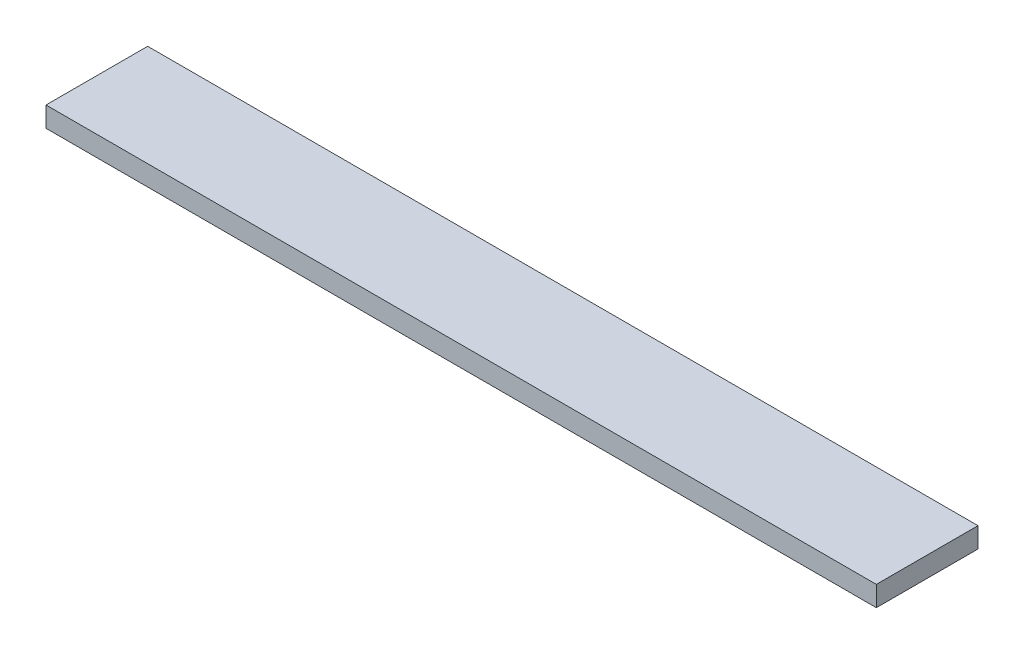
ISO-10303-21;
HEADER;
FILE_DESCRIPTION(('STEP AP214'),'2;1');
FILE_NAME('part.step','',(''),(''),'','','');
FILE_SCHEMA(('AUTOMOTIVE_DESIGN { 1 0 10303 214 1 1 1 1 }'));
ENDSEC;
DATA;
#1=APPLICATION_CONTEXT('core data for automotive mechanical design processes');
#2=APPLICATION_PROTOCOL_DEFINITION('international standard','automotive_design',2000,#1);
#3=PRODUCT_CONTEXT('',#1,'mechanical');
#4=PRODUCT('Part','Part','',(#3));
#5=PRODUCT_RELATED_PRODUCT_CATEGORY('part','',(#4));
#6=PRODUCT_DEFINITION_FORMATION('','',#4);
#7=PRODUCT_DEFINITION_CONTEXT('part definition',#1,'design');
#8=PRODUCT_DEFINITION('design','',#6,#7);
#9=PRODUCT_DEFINITION_SHAPE('','',#8);
#10=(LENGTH_UNIT() NAMED_UNIT(*) SI_UNIT(.MILLI.,.METRE.));
#11=(NAMED_UNIT(*) PLANE_ANGLE_UNIT() SI_UNIT($,.RADIAN.));
#12=(NAMED_UNIT(*) SI_UNIT($,.STERADIAN.) SOLID_ANGLE_UNIT());
#13=UNCERTAINTY_MEASURE_WITH_UNIT(LENGTH_MEASURE(1.E-05),#10,'distance_accuracy_value','');
#14=(GEOMETRIC_REPRESENTATION_CONTEXT(3) GLOBAL_UNCERTAINTY_ASSIGNED_CONTEXT((#13)) GLOBAL_UNIT_ASSIGNED_CONTEXT((#10,
#11,#12)) REPRESENTATION_CONTEXT('',''));
#15=CARTESIAN_POINT('',(0.,0.,0.));
#16=DIRECTION('',(0.,0.,1.));
#17=DIRECTION('',(1.,0.,0.));
#18=AXIS2_PLACEMENT_3D('',#15,#16,#17);
#19=CARTESIAN_POINT('',(0.,19.05,0.));
#20=DIRECTION('',(1.,0.,0.));
#21=DIRECTION('',(0.,0.,-1.));
#22=AXIS2_PLACEMENT_3D('',#19,#20,#21);
#23=PLANE('',#22);
#24=DIRECTION('',(0.,0.,1.));
#25=VECTOR('',#24,1.);
#26=CARTESIAN_POINT('',(0.,0.,0.));
#27=LINE('',#26,#25);
#28=CARTESIAN_POINT('',(0.,0.,-95.73895));
#29=VERTEX_POINT('',#28);
#30=CARTESIAN_POINT('',(0.,0.,0.));
#31=VERTEX_POINT('',#30);
#32=EDGE_CURVE('E101',#29,#31,#27,.T.);
#33=ORIENTED_EDGE('',*,*,#32,.T.);
#34=DIRECTION('',(0.,-1.,0.));
#35=VECTOR('',#34,1.);
#36=CARTESIAN_POINT('',(0.,19.05,0.));
#37=LINE('',#36,#35);
#38=CARTESIAN_POINT('',(0.,19.05,0.));
#39=VERTEX_POINT('',#38);
#40=EDGE_CURVE('E11',#39,#31,#37,.T.);
#41=ORIENTED_EDGE('',*,*,#40,.F.);
#42=DIRECTION('',(0.,0.,1.));
#43=VECTOR('',#42,1.);
#44=CARTESIAN_POINT('',(0.,19.05,0.));
#45=LINE('',#44,#43);
#46=CARTESIAN_POINT('',(0.,19.05,-95.73895));
#47=VERTEX_POINT('',#46);
#48=EDGE_CURVE('E89',#47,#39,#45,.T.);
#49=ORIENTED_EDGE('',*,*,#48,.F.);
#50=DIRECTION('',(0.,-1.,0.));
#51=VECTOR('',#50,1.);
#52=CARTESIAN_POINT('',(0.,19.05,-95.73895));
#53=LINE('',#52,#51);
#54=EDGE_CURVE('E97',#47,#29,#53,.T.);
#55=ORIENTED_EDGE('',*,*,#54,.T.);
#56=EDGE_LOOP('',(#33,#41,#49,#55));
#57=FACE_BOUND('',#56,.T.);
#58=ADVANCED_FACE('F38',(#57),#23,.F.);
#59=CARTESIAN_POINT('',(0.,19.05,0.));
#60=DIRECTION('',(0.,0.,-1.));
#61=DIRECTION('',(-1.,0.,0.));
#62=AXIS2_PLACEMENT_3D('',#59,#60,#61);
#63=PLANE('',#62);
#64=DIRECTION('',(1.,0.,0.));
#65=VECTOR('',#64,1.);
#66=CARTESIAN_POINT('',(0.,0.,0.));
#67=LINE('',#66,#65);
#68=CARTESIAN_POINT('',(781.84375,0.,0.));
#69=VERTEX_POINT('',#68);
#70=EDGE_CURVE('E93',#31,#69,#67,.T.);
#71=ORIENTED_EDGE('',*,*,#70,.T.);
#72=DIRECTION('',(0.,-1.,0.));
#73=VECTOR('',#72,1.);
#74=CARTESIAN_POINT('',(781.84375,19.05,0.));
#75=LINE('',#74,#73);
#76=CARTESIAN_POINT('',(781.84375,19.05,0.));
#77=VERTEX_POINT('',#76);
#78=EDGE_CURVE('E46',#77,#69,#75,.T.);
#79=ORIENTED_EDGE('',*,*,#78,.F.);
#80=DIRECTION('',(1.,0.,0.));
#81=VECTOR('',#80,1.);
#82=CARTESIAN_POINT('',(0.,19.05,0.));
#83=LINE('',#82,#81);
#84=EDGE_CURVE('E84',#39,#77,#83,.T.);
#85=ORIENTED_EDGE('',*,*,#84,.F.);
#86=ORIENTED_EDGE('',*,*,#40,.T.);
#87=EDGE_LOOP('',(#71,#79,#85,#86));
#88=FACE_BOUND('',#87,.T.);
#89=ADVANCED_FACE('F92',(#88),#63,.F.);
#90=CARTESIAN_POINT('',(781.84375,19.05,0.));
#91=DIRECTION('',(-1.,0.,0.));
#92=DIRECTION('',(0.,0.,1.));
#93=AXIS2_PLACEMENT_3D('',#90,#91,#92);
#94=PLANE('',#93);
#95=DIRECTION('',(0.,0.,-1.));
#96=VECTOR('',#95,1.);
#97=CARTESIAN_POINT('',(781.84375,0.,0.));
#98=LINE('',#97,#96);
#99=CARTESIAN_POINT('',(781.84375,0.,-95.73895));
#100=VERTEX_POINT('',#99);
#101=EDGE_CURVE('E71',#69,#100,#98,.T.);
#102=ORIENTED_EDGE('',*,*,#101,.T.);
#103=DIRECTION('',(0.,-1.,0.));
#104=VECTOR('',#103,1.);
#105=CARTESIAN_POINT('',(781.84375,19.05,-95.73895));
#106=LINE('',#105,#104);
#107=CARTESIAN_POINT('',(781.84375,19.05,-95.73895));
#108=VERTEX_POINT('',#107);
#109=EDGE_CURVE('E94',#108,#100,#106,.T.);
#110=ORIENTED_EDGE('',*,*,#109,.F.);
#111=DIRECTION('',(0.,0.,-1.));
#112=VECTOR('',#111,1.);
#113=CARTESIAN_POINT('',(781.84375,19.05,0.));
#114=LINE('',#113,#112);
#115=EDGE_CURVE('E87',#77,#108,#114,.T.);
#116=ORIENTED_EDGE('',*,*,#115,.F.);
#117=ORIENTED_EDGE('',*,*,#78,.T.);
#118=EDGE_LOOP('',(#102,#110,#116,#117));
#119=FACE_BOUND('',#118,.T.);
#120=ADVANCED_FACE('F95',(#119),#94,.F.);
#121=CARTESIAN_POINT('',(0.,19.05,-95.73895));
#122=DIRECTION('',(0.,0.,1.));
#123=DIRECTION('',(1.,0.,0.));
#124=AXIS2_PLACEMENT_3D('',#121,#122,#123);
#125=PLANE('',#124);
#126=DIRECTION('',(-1.,0.,0.));
#127=VECTOR('',#126,1.);
#128=CARTESIAN_POINT('',(0.,0.,-95.73895));
#129=LINE('',#128,#127);
#130=EDGE_CURVE('E77',#100,#29,#129,.T.);
#131=ORIENTED_EDGE('',*,*,#130,.T.);
#132=ORIENTED_EDGE('',*,*,#54,.F.);
#133=DIRECTION('',(-1.,0.,0.));
#134=VECTOR('',#133,1.);
#135=CARTESIAN_POINT('',(0.,19.05,-95.73895));
#136=LINE('',#135,#134);
#137=EDGE_CURVE('E54',#108,#47,#136,.T.);
#138=ORIENTED_EDGE('',*,*,#137,.F.);
#139=ORIENTED_EDGE('',*,*,#109,.T.);
#140=EDGE_LOOP('',(#131,#132,#138,#139));
#141=FACE_BOUND('',#140,.T.);
#142=ADVANCED_FACE('F108',(#141),#125,.F.);
#143=CARTESIAN_POINT('',(0.,19.05,0.));
#144=DIRECTION('',(0.,-1.,0.));
#145=DIRECTION('',(0.,0.,-1.));
#146=AXIS2_PLACEMENT_3D('',#143,#144,#145);
#147=PLANE('',#146);
#148=ORIENTED_EDGE('',*,*,#48,.T.);
#149=ORIENTED_EDGE('',*,*,#84,.T.);
#150=ORIENTED_EDGE('',*,*,#115,.T.);
#151=ORIENTED_EDGE('',*,*,#137,.T.);
#152=EDGE_LOOP('',(#148,#149,#150,#151));
#153=FACE_BOUND('',#152,.T.);
#154=ADVANCED_FACE('F85',(#153),#147,.F.);
#155=CARTESIAN_POINT('',(0.,0.,0.));
#156=DIRECTION('',(0.,-1.,0.));
#157=DIRECTION('',(0.,0.,-1.));
#158=AXIS2_PLACEMENT_3D('',#155,#156,#157);
#159=PLANE('',#158);
#160=ORIENTED_EDGE('',*,*,#32,.F.);
#161=ORIENTED_EDGE('',*,*,#130,.F.);
#162=ORIENTED_EDGE('',*,*,#101,.F.);
#163=ORIENTED_EDGE('',*,*,#70,.F.);
#164=EDGE_LOOP('',(#160,#161,#162,#163));
#165=FACE_BOUND('',#164,.T.);
#166=ADVANCED_FACE('F111',(#165),#159,.T.);
#167=CLOSED_SHELL('',(#58,#89,#120,#142,#154,#166));
#168=MANIFOLD_SOLID_BREP('B2',#167);
#169=ADVANCED_BREP_SHAPE_REPRESENTATION('',(#18,#168),#14);
#170=SHAPE_DEFINITION_REPRESENTATION(#9,#169);
ENDSEC;
END-ISO-10303-21;
